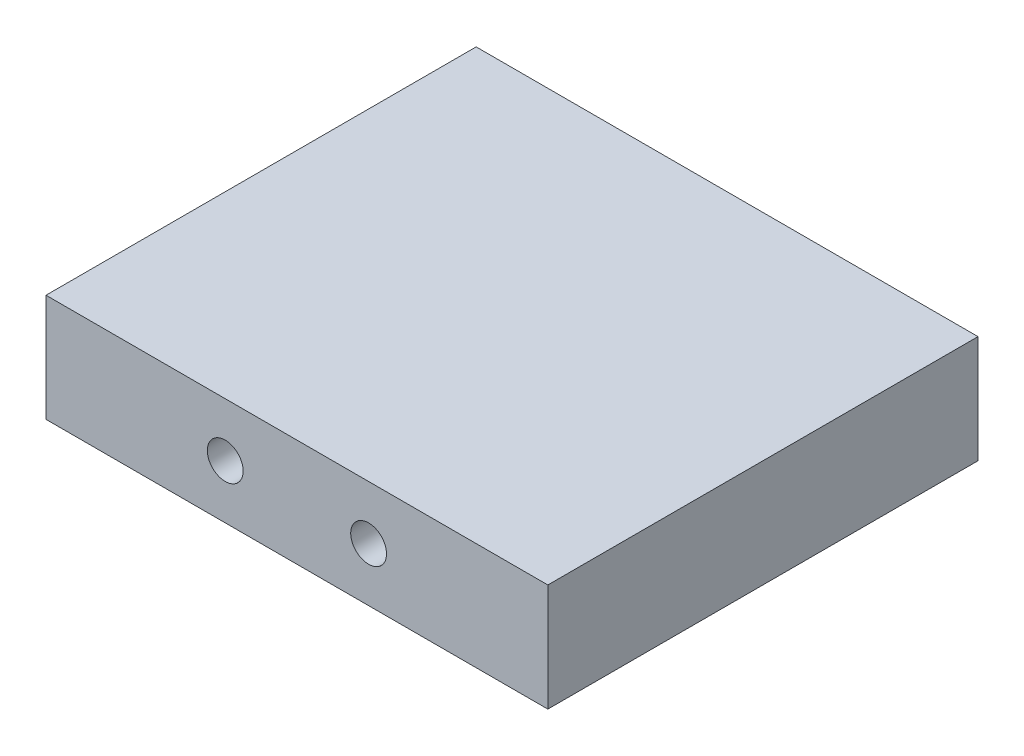
ISO-10303-21;
HEADER;
FILE_DESCRIPTION(('STEP AP214'),'2;1');
FILE_NAME('part.step','',(''),(''),'','','');
FILE_SCHEMA(('AUTOMOTIVE_DESIGN { 1 0 10303 214 1 1 1 1 }'));
ENDSEC;
DATA;
#1=APPLICATION_CONTEXT('core data for automotive mechanical design processes');
#2=APPLICATION_PROTOCOL_DEFINITION('international standard','automotive_design',2000,#1);
#3=PRODUCT_CONTEXT('',#1,'mechanical');
#4=PRODUCT('Part','Part','',(#3));
#5=PRODUCT_RELATED_PRODUCT_CATEGORY('part','',(#4));
#6=PRODUCT_DEFINITION_FORMATION('','',#4);
#7=PRODUCT_DEFINITION_CONTEXT('part definition',#1,'design');
#8=PRODUCT_DEFINITION('design','',#6,#7);
#9=PRODUCT_DEFINITION_SHAPE('','',#8);
#10=(LENGTH_UNIT() NAMED_UNIT(*) SI_UNIT(.MILLI.,.METRE.));
#11=(NAMED_UNIT(*) PLANE_ANGLE_UNIT() SI_UNIT($,.RADIAN.));
#12=(NAMED_UNIT(*) SI_UNIT($,.STERADIAN.) SOLID_ANGLE_UNIT());
#13=UNCERTAINTY_MEASURE_WITH_UNIT(LENGTH_MEASURE(1.E-05),#10,'distance_accuracy_value','');
#14=(GEOMETRIC_REPRESENTATION_CONTEXT(3) GLOBAL_UNCERTAINTY_ASSIGNED_CONTEXT((#13)) GLOBAL_UNIT_ASSIGNED_CONTEXT((#10,
#11,#12)) REPRESENTATION_CONTEXT('',''));
#15=CARTESIAN_POINT('',(0.,0.,0.));
#16=DIRECTION('',(0.,0.,1.));
#17=DIRECTION('',(1.,0.,0.));
#18=AXIS2_PLACEMENT_3D('',#15,#16,#17);
#19=CARTESIAN_POINT('',(44.45,19.05,-38.1));
#20=DIRECTION('',(-1.,0.,0.));
#21=DIRECTION('',(0.,0.,1.));
#22=AXIS2_PLACEMENT_3D('',#19,#20,#21);
#23=PLANE('',#22);
#24=DIRECTION('',(0.,0.,-1.));
#25=VECTOR('',#24,1.);
#26=CARTESIAN_POINT('',(44.45,0.,-38.1));
#27=LINE('',#26,#25);
#28=CARTESIAN_POINT('',(44.45,0.,38.1));
#29=VERTEX_POINT('',#28);
#30=CARTESIAN_POINT('',(44.45,0.,-38.1));
#31=VERTEX_POINT('',#30);
#32=EDGE_CURVE('E107',#29,#31,#27,.T.);
#33=ORIENTED_EDGE('',*,*,#32,.T.);
#34=DIRECTION('',(0.,-1.,0.));
#35=VECTOR('',#34,1.);
#36=CARTESIAN_POINT('',(44.45,19.05,-38.1));
#37=LINE('',#36,#35);
#38=CARTESIAN_POINT('',(44.45,19.05,-38.1));
#39=VERTEX_POINT('',#38);
#40=EDGE_CURVE('E11',#39,#31,#37,.T.);
#41=ORIENTED_EDGE('',*,*,#40,.F.);
#42=DIRECTION('',(0.,0.,-1.));
#43=VECTOR('',#42,1.);
#44=CARTESIAN_POINT('',(44.45,19.05,-38.1));
#45=LINE('',#44,#43);
#46=CARTESIAN_POINT('',(44.45,19.05,38.1));
#47=VERTEX_POINT('',#46);
#48=EDGE_CURVE('E90',#47,#39,#45,.T.);
#49=ORIENTED_EDGE('',*,*,#48,.F.);
#50=DIRECTION('',(0.,-1.,0.));
#51=VECTOR('',#50,1.);
#52=CARTESIAN_POINT('',(44.45,19.05,38.1));
#53=LINE('',#52,#51);
#54=EDGE_CURVE('E103',#47,#29,#53,.T.);
#55=ORIENTED_EDGE('',*,*,#54,.T.);
#56=EDGE_LOOP('',(#33,#41,#49,#55));
#57=FACE_BOUND('',#56,.T.);
#58=ADVANCED_FACE('F38',(#57),#23,.F.);
#59=CARTESIAN_POINT('',(-44.45,19.05,-38.1));
#60=DIRECTION('',(0.,0.,1.));
#61=DIRECTION('',(1.,0.,0.));
#62=AXIS2_PLACEMENT_3D('',#59,#60,#61);
#63=PLANE('',#62);
#64=DIRECTION('',(-1.,0.,0.));
#65=VECTOR('',#64,1.);
#66=CARTESIAN_POINT('',(-44.45,0.,-38.1));
#67=LINE('',#66,#65);
#68=CARTESIAN_POINT('',(-44.45,0.,-38.1));
#69=VERTEX_POINT('',#68);
#70=EDGE_CURVE('E95',#31,#69,#67,.T.);
#71=ORIENTED_EDGE('',*,*,#70,.T.);
#72=DIRECTION('',(0.,-1.,0.));
#73=VECTOR('',#72,1.);
#74=CARTESIAN_POINT('',(-44.45,19.05,-38.1));
#75=LINE('',#74,#73);
#76=CARTESIAN_POINT('',(-44.45,19.05,-38.1));
#77=VERTEX_POINT('',#76);
#78=EDGE_CURVE('E47',#77,#69,#75,.T.);
#79=ORIENTED_EDGE('',*,*,#78,.F.);
#80=DIRECTION('',(-1.,0.,0.));
#81=VECTOR('',#80,1.);
#82=CARTESIAN_POINT('',(-44.45,19.05,-38.1));
#83=LINE('',#82,#81);
#84=EDGE_CURVE('E85',#39,#77,#83,.T.);
#85=ORIENTED_EDGE('',*,*,#84,.F.);
#86=ORIENTED_EDGE('',*,*,#40,.T.);
#87=EDGE_LOOP('',(#71,#79,#85,#86));
#88=FACE_BOUND('',#87,.T.);
#89=ADVANCED_FACE('F94',(#88),#63,.F.);
#90=CARTESIAN_POINT('',(-44.45,19.05,-38.1));
#91=DIRECTION('',(1.,0.,0.));
#92=DIRECTION('',(0.,0.,-1.));
#93=AXIS2_PLACEMENT_3D('',#90,#91,#92);
#94=PLANE('',#93);
#95=DIRECTION('',(0.,0.,1.));
#96=VECTOR('',#95,1.);
#97=CARTESIAN_POINT('',(-44.45,0.,-38.1));
#98=LINE('',#97,#96);
#99=CARTESIAN_POINT('',(-44.45,0.,38.1));
#100=VERTEX_POINT('',#99);
#101=EDGE_CURVE('E72',#69,#100,#98,.T.);
#102=ORIENTED_EDGE('',*,*,#101,.T.);
#103=DIRECTION('',(0.,-1.,0.));
#104=VECTOR('',#103,1.);
#105=CARTESIAN_POINT('',(-44.45,19.05,38.1));
#106=LINE('',#105,#104);
#107=CARTESIAN_POINT('',(-44.45,19.05,38.1));
#108=VERTEX_POINT('',#107);
#109=EDGE_CURVE('E97',#108,#100,#106,.T.);
#110=ORIENTED_EDGE('',*,*,#109,.F.);
#111=DIRECTION('',(0.,0.,1.));
#112=VECTOR('',#111,1.);
#113=CARTESIAN_POINT('',(-44.45,19.05,-38.1));
#114=LINE('',#113,#112);
#115=EDGE_CURVE('E88',#77,#108,#114,.T.);
#116=ORIENTED_EDGE('',*,*,#115,.F.);
#117=ORIENTED_EDGE('',*,*,#78,.T.);
#118=EDGE_LOOP('',(#102,#110,#116,#117));
#119=FACE_BOUND('',#118,.T.);
#120=ADVANCED_FACE('F98',(#119),#94,.F.);
#121=CARTESIAN_POINT('',(-44.45,19.05,38.1));
#122=DIRECTION('',(0.,0.,-1.));
#123=DIRECTION('',(-1.,0.,0.));
#124=AXIS2_PLACEMENT_3D('',#121,#122,#123);
#125=PLANE('',#124);
#126=CARTESIAN_POINT('',(-12.7,9.525,38.1));
#127=DIRECTION('',(0.,0.,1.));
#128=DIRECTION('',(1.,0.,0.));
#129=AXIS2_PLACEMENT_3D('',#126,#127,#128);
#130=CIRCLE('',#129,3.175);
#131=CARTESIAN_POINT('',(-9.525,9.525,38.1));
#132=VERTEX_POINT('',#131);
#133=EDGE_CURVE('E138',#132,#132,#130,.T.);
#134=ORIENTED_EDGE('',*,*,#133,.F.);
#135=EDGE_LOOP('',(#134));
#136=FACE_BOUND('',#135,.T.);
#137=CARTESIAN_POINT('',(12.7,9.525,38.1));
#138=DIRECTION('',(0.,0.,1.));
#139=DIRECTION('',(1.,0.,0.));
#140=AXIS2_PLACEMENT_3D('',#137,#138,#139);
#141=CIRCLE('',#140,3.175);
#142=CARTESIAN_POINT('',(15.875,9.525,38.1));
#143=VERTEX_POINT('',#142);
#144=EDGE_CURVE('E130',#143,#143,#141,.T.);
#145=ORIENTED_EDGE('',*,*,#144,.F.);
#146=EDGE_LOOP('',(#145));
#147=FACE_BOUND('',#146,.T.);
#148=DIRECTION('',(1.,0.,0.));
#149=VECTOR('',#148,1.);
#150=CARTESIAN_POINT('',(-44.45,0.,38.1));
#151=LINE('',#150,#149);
#152=EDGE_CURVE('E78',#100,#29,#151,.T.);
#153=ORIENTED_EDGE('',*,*,#152,.T.);
#154=ORIENTED_EDGE('',*,*,#54,.F.);
#155=DIRECTION('',(1.,0.,0.));
#156=VECTOR('',#155,1.);
#157=CARTESIAN_POINT('',(-44.45,19.05,38.1));
#158=LINE('',#157,#156);
#159=EDGE_CURVE('E55',#108,#47,#158,.T.);
#160=ORIENTED_EDGE('',*,*,#159,.F.);
#161=ORIENTED_EDGE('',*,*,#109,.T.);
#162=EDGE_LOOP('',(#153,#154,#160,#161));
#163=FACE_BOUND('',#162,.T.);
#164=ADVANCED_FACE('F122',(#136,#147,#163),#125,.F.);
#165=CARTESIAN_POINT('',(0.,19.05,0.));
#166=DIRECTION('',(0.,1.,0.));
#167=DIRECTION('',(0.,0.,1.));
#168=AXIS2_PLACEMENT_3D('',#165,#166,#167);
#169=PLANE('',#168);
#170=ORIENTED_EDGE('',*,*,#48,.T.);
#171=ORIENTED_EDGE('',*,*,#84,.T.);
#172=ORIENTED_EDGE('',*,*,#115,.T.);
#173=ORIENTED_EDGE('',*,*,#159,.T.);
#174=EDGE_LOOP('',(#170,#171,#172,#173));
#175=FACE_BOUND('',#174,.T.);
#176=ADVANCED_FACE('F86',(#175),#169,.T.);
#177=CARTESIAN_POINT('',(0.,0.,0.));
#178=DIRECTION('',(0.,1.,0.));
#179=DIRECTION('',(0.,0.,1.));
#180=AXIS2_PLACEMENT_3D('',#177,#178,#179);
#181=PLANE('',#180);
#182=ORIENTED_EDGE('',*,*,#32,.F.);
#183=ORIENTED_EDGE('',*,*,#152,.F.);
#184=ORIENTED_EDGE('',*,*,#101,.F.);
#185=ORIENTED_EDGE('',*,*,#70,.F.);
#186=EDGE_LOOP('',(#182,#183,#184,#185));
#187=FACE_BOUND('',#186,.T.);
#188=ADVANCED_FACE('F125',(#187),#181,.F.);
#189=CARTESIAN_POINT('',(12.7,9.525,25.4));
#190=DIRECTION('',(0.,0.,1.));
#191=DIRECTION('',(1.,0.,0.));
#192=AXIS2_PLACEMENT_3D('',#189,#190,#191);
#193=CYLINDRICAL_SURFACE('',#192,3.175);
#194=CARTESIAN_POINT('',(12.7,9.525,25.4));
#195=DIRECTION('',(0.,0.,1.));
#196=DIRECTION('',(1.,0.,0.));
#197=AXIS2_PLACEMENT_3D('',#194,#195,#196);
#198=CIRCLE('',#197,3.175);
#199=CARTESIAN_POINT('',(15.875,9.525,25.4));
#200=VERTEX_POINT('',#199);
#201=EDGE_CURVE('E134',#200,#200,#198,.T.);
#202=ORIENTED_EDGE('',*,*,#201,.F.);
#203=EDGE_LOOP('',(#202));
#204=FACE_BOUND('',#203,.T.);
#205=ORIENTED_EDGE('',*,*,#144,.T.);
#206=EDGE_LOOP('',(#205));
#207=FACE_BOUND('',#206,.T.);
#208=ADVANCED_FACE('F161',(#204,#207),#193,.F.);
#209=CARTESIAN_POINT('',(12.7,9.525,25.4));
#210=DIRECTION('',(0.,0.,1.));
#211=DIRECTION('',(1.,0.,0.));
#212=AXIS2_PLACEMENT_3D('',#209,#210,#211);
#213=PLANE('',#212);
#214=ORIENTED_EDGE('',*,*,#201,.T.);
#215=EDGE_LOOP('',(#214));
#216=FACE_BOUND('',#215,.T.);
#217=ADVANCED_FACE('F152',(#216),#213,.T.);
#218=CARTESIAN_POINT('',(-12.7,9.525,25.4));
#219=DIRECTION('',(0.,0.,1.));
#220=DIRECTION('',(1.,0.,0.));
#221=AXIS2_PLACEMENT_3D('',#218,#219,#220);
#222=CYLINDRICAL_SURFACE('',#221,3.175);
#223=CARTESIAN_POINT('',(-12.7,9.525,25.4));
#224=DIRECTION('',(0.,0.,1.));
#225=DIRECTION('',(1.,0.,0.));
#226=AXIS2_PLACEMENT_3D('',#223,#224,#225);
#227=CIRCLE('',#226,3.175);
#228=CARTESIAN_POINT('',(-9.525,9.525,25.4));
#229=VERTEX_POINT('',#228);
#230=EDGE_CURVE('E111',#229,#229,#227,.T.);
#231=ORIENTED_EDGE('',*,*,#230,.F.);
#232=EDGE_LOOP('',(#231));
#233=FACE_BOUND('',#232,.T.);
#234=ORIENTED_EDGE('',*,*,#133,.T.);
#235=EDGE_LOOP('',(#234));
#236=FACE_BOUND('',#235,.T.);
#237=ADVANCED_FACE('F149',(#233,#236),#222,.F.);
#238=CARTESIAN_POINT('',(-12.7,9.525,25.4));
#239=DIRECTION('',(0.,0.,1.));
#240=DIRECTION('',(1.,0.,0.));
#241=AXIS2_PLACEMENT_3D('',#238,#239,#240);
#242=PLANE('',#241);
#243=ORIENTED_EDGE('',*,*,#230,.T.);
#244=EDGE_LOOP('',(#243));
#245=FACE_BOUND('',#244,.T.);
#246=ADVANCED_FACE('F147',(#245),#242,.T.);
#247=CLOSED_SHELL('',(#58,#89,#120,#164,#176,#188,#208,#217,#237,#246));
#248=MANIFOLD_SOLID_BREP('B2',#247);
#249=ADVANCED_BREP_SHAPE_REPRESENTATION('',(#18,#248),#14);
#250=SHAPE_DEFINITION_REPRESENTATION(#9,#249);
ENDSEC;
END-ISO-10303-21;
